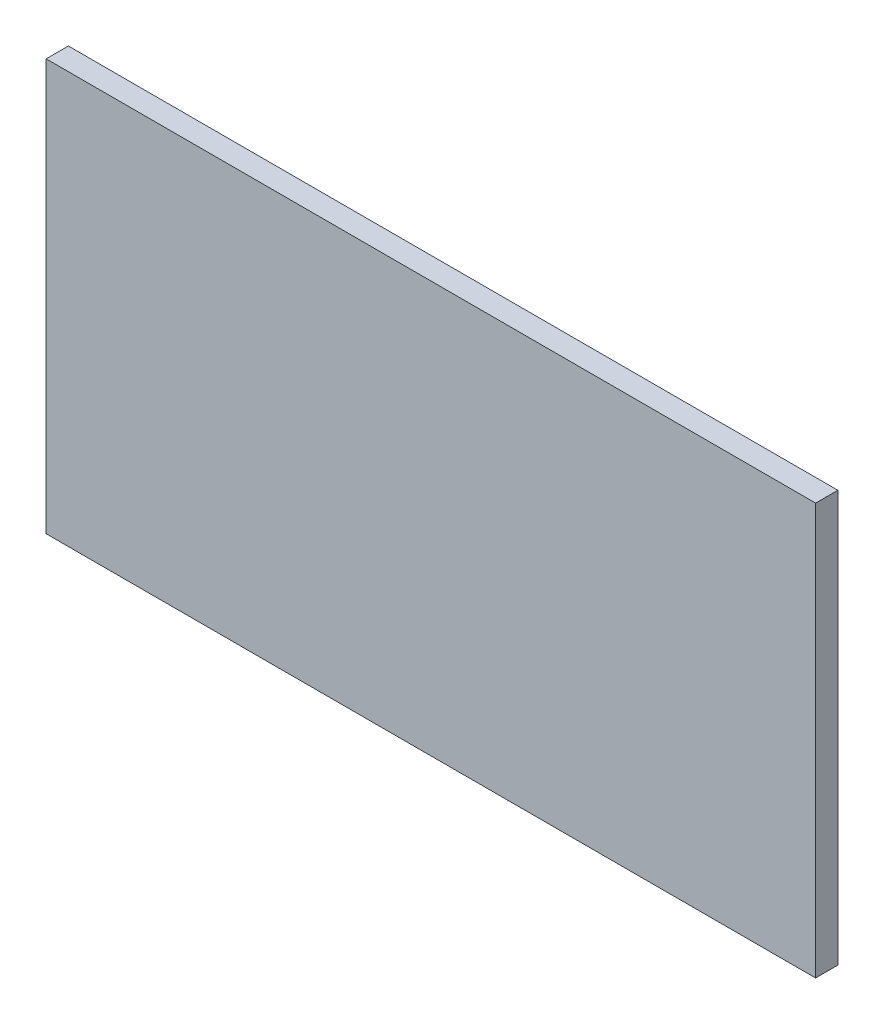
ISO-10303-21;
HEADER;
FILE_DESCRIPTION(('STEP AP214'),'2;1');
FILE_NAME('part.step','',(''),(''),'','','');
FILE_SCHEMA(('AUTOMOTIVE_DESIGN { 1 0 10303 214 1 1 1 1 }'));
ENDSEC;
DATA;
#1=APPLICATION_CONTEXT('core data for automotive mechanical design processes');
#2=APPLICATION_PROTOCOL_DEFINITION('international standard','automotive_design',2000,#1);
#3=PRODUCT_CONTEXT('',#1,'mechanical');
#4=PRODUCT('Part','Part','',(#3));
#5=PRODUCT_RELATED_PRODUCT_CATEGORY('part','',(#4));
#6=PRODUCT_DEFINITION_FORMATION('','',#4);
#7=PRODUCT_DEFINITION_CONTEXT('part definition',#1,'design');
#8=PRODUCT_DEFINITION('design','',#6,#7);
#9=PRODUCT_DEFINITION_SHAPE('','',#8);
#10=(LENGTH_UNIT() NAMED_UNIT(*) SI_UNIT(.MILLI.,.METRE.));
#11=(NAMED_UNIT(*) PLANE_ANGLE_UNIT() SI_UNIT($,.RADIAN.));
#12=(NAMED_UNIT(*) SI_UNIT($,.STERADIAN.) SOLID_ANGLE_UNIT());
#13=UNCERTAINTY_MEASURE_WITH_UNIT(LENGTH_MEASURE(1.E-05),#10,'distance_accuracy_value','');
#14=(GEOMETRIC_REPRESENTATION_CONTEXT(3) GLOBAL_UNCERTAINTY_ASSIGNED_CONTEXT((#13)) GLOBAL_UNIT_ASSIGNED_CONTEXT((#10,
#11,#12)) REPRESENTATION_CONTEXT('',''));
#15=CARTESIAN_POINT('',(0.,0.,0.));
#16=DIRECTION('',(0.,0.,1.));
#17=DIRECTION('',(1.,0.,0.));
#18=AXIS2_PLACEMENT_3D('',#15,#16,#17);
#19=CARTESIAN_POINT('',(-311.5,-166.5,18.));
#20=DIRECTION('',(1.,0.,0.));
#21=DIRECTION('',(0.,0.,-1.));
#22=AXIS2_PLACEMENT_3D('',#19,#20,#21);
#23=PLANE('',#22);
#24=DIRECTION('',(0.,-1.,0.));
#25=VECTOR('',#24,1.);
#26=CARTESIAN_POINT('',(-311.5,-166.5,0.));
#27=LINE('',#26,#25);
#28=CARTESIAN_POINT('',(-311.5,166.5,0.));
#29=VERTEX_POINT('',#28);
#30=CARTESIAN_POINT('',(-311.5,-166.5,0.));
#31=VERTEX_POINT('',#30);
#32=EDGE_CURVE('E96',#29,#31,#27,.T.);
#33=ORIENTED_EDGE('',*,*,#32,.T.);
#34=DIRECTION('',(0.,0.,-1.));
#35=VECTOR('',#34,1.);
#36=CARTESIAN_POINT('',(-311.5,-166.5,18.));
#37=LINE('',#36,#35);
#38=CARTESIAN_POINT('',(-311.5,-166.5,18.));
#39=VERTEX_POINT('',#38);
#40=EDGE_CURVE('E11',#39,#31,#37,.T.);
#41=ORIENTED_EDGE('',*,*,#40,.F.);
#42=DIRECTION('',(0.,-1.,0.));
#43=VECTOR('',#42,1.);
#44=CARTESIAN_POINT('',(-311.5,-166.5,18.));
#45=LINE('',#44,#43);
#46=CARTESIAN_POINT('',(-311.5,166.5,18.));
#47=VERTEX_POINT('',#46);
#48=EDGE_CURVE('E84',#47,#39,#45,.T.);
#49=ORIENTED_EDGE('',*,*,#48,.F.);
#50=DIRECTION('',(0.,0.,-1.));
#51=VECTOR('',#50,1.);
#52=CARTESIAN_POINT('',(-311.5,166.5,18.));
#53=LINE('',#52,#51);
#54=EDGE_CURVE('E92',#47,#29,#53,.T.);
#55=ORIENTED_EDGE('',*,*,#54,.T.);
#56=EDGE_LOOP('',(#33,#41,#49,#55));
#57=FACE_BOUND('',#56,.T.);
#58=ADVANCED_FACE('F33',(#57),#23,.F.);
#59=CARTESIAN_POINT('',(311.5,-166.5,18.));
#60=DIRECTION('',(0.,1.,0.));
#61=DIRECTION('',(-1.,0.,0.));
#62=AXIS2_PLACEMENT_3D('',#59,#60,#61);
#63=PLANE('',#62);
#64=DIRECTION('',(1.,0.,0.));
#65=VECTOR('',#64,1.);
#66=CARTESIAN_POINT('',(311.5,-166.5,0.));
#67=LINE('',#66,#65);
#68=CARTESIAN_POINT('',(311.5,-166.5,0.));
#69=VERTEX_POINT('',#68);
#70=EDGE_CURVE('E88',#31,#69,#67,.T.);
#71=ORIENTED_EDGE('',*,*,#70,.T.);
#72=DIRECTION('',(0.,0.,-1.));
#73=VECTOR('',#72,1.);
#74=CARTESIAN_POINT('',(311.5,-166.5,18.));
#75=LINE('',#74,#73);
#76=CARTESIAN_POINT('',(311.5,-166.5,18.));
#77=VERTEX_POINT('',#76);
#78=EDGE_CURVE('E41',#77,#69,#75,.T.);
#79=ORIENTED_EDGE('',*,*,#78,.F.);
#80=DIRECTION('',(1.,0.,0.));
#81=VECTOR('',#80,1.);
#82=CARTESIAN_POINT('',(311.5,-166.5,18.));
#83=LINE('',#82,#81);
#84=EDGE_CURVE('E79',#39,#77,#83,.T.);
#85=ORIENTED_EDGE('',*,*,#84,.F.);
#86=ORIENTED_EDGE('',*,*,#40,.T.);
#87=EDGE_LOOP('',(#71,#79,#85,#86));
#88=FACE_BOUND('',#87,.T.);
#89=ADVANCED_FACE('F87',(#88),#63,.F.);
#90=CARTESIAN_POINT('',(311.5,-166.5,18.));
#91=DIRECTION('',(-1.,0.,0.));
#92=DIRECTION('',(0.,0.,1.));
#93=AXIS2_PLACEMENT_3D('',#90,#91,#92);
#94=PLANE('',#93);
#95=DIRECTION('',(0.,1.,0.));
#96=VECTOR('',#95,1.);
#97=CARTESIAN_POINT('',(311.5,-166.5,0.));
#98=LINE('',#97,#96);
#99=CARTESIAN_POINT('',(311.5,166.5,0.));
#100=VERTEX_POINT('',#99);
#101=EDGE_CURVE('E66',#69,#100,#98,.T.);
#102=ORIENTED_EDGE('',*,*,#101,.T.);
#103=DIRECTION('',(0.,0.,-1.));
#104=VECTOR('',#103,1.);
#105=CARTESIAN_POINT('',(311.5,166.5,18.));
#106=LINE('',#105,#104);
#107=CARTESIAN_POINT('',(311.5,166.5,18.));
#108=VERTEX_POINT('',#107);
#109=EDGE_CURVE('E89',#108,#100,#106,.T.);
#110=ORIENTED_EDGE('',*,*,#109,.F.);
#111=DIRECTION('',(0.,1.,0.));
#112=VECTOR('',#111,1.);
#113=CARTESIAN_POINT('',(311.5,-166.5,18.));
#114=LINE('',#113,#112);
#115=EDGE_CURVE('E82',#77,#108,#114,.T.);
#116=ORIENTED_EDGE('',*,*,#115,.F.);
#117=ORIENTED_EDGE('',*,*,#78,.T.);
#118=EDGE_LOOP('',(#102,#110,#116,#117));
#119=FACE_BOUND('',#118,.T.);
#120=ADVANCED_FACE('F90',(#119),#94,.F.);
#121=CARTESIAN_POINT('',(311.5,166.5,18.));
#122=DIRECTION('',(0.,-1.,0.));
#123=DIRECTION('',(1.,0.,0.));
#124=AXIS2_PLACEMENT_3D('',#121,#122,#123);
#125=PLANE('',#124);
#126=DIRECTION('',(-1.,0.,0.));
#127=VECTOR('',#126,1.);
#128=CARTESIAN_POINT('',(311.5,166.5,0.));
#129=LINE('',#128,#127);
#130=EDGE_CURVE('E72',#100,#29,#129,.T.);
#131=ORIENTED_EDGE('',*,*,#130,.T.);
#132=ORIENTED_EDGE('',*,*,#54,.F.);
#133=DIRECTION('',(-1.,0.,0.));
#134=VECTOR('',#133,1.);
#135=CARTESIAN_POINT('',(311.5,166.5,18.));
#136=LINE('',#135,#134);
#137=EDGE_CURVE('E49',#108,#47,#136,.T.);
#138=ORIENTED_EDGE('',*,*,#137,.F.);
#139=ORIENTED_EDGE('',*,*,#109,.T.);
#140=EDGE_LOOP('',(#131,#132,#138,#139));
#141=FACE_BOUND('',#140,.T.);
#142=ADVANCED_FACE('F103',(#141),#125,.F.);
#143=CARTESIAN_POINT('',(0.,0.,18.));
#144=DIRECTION('',(0.,0.,1.));
#145=DIRECTION('',(1.,0.,0.));
#146=AXIS2_PLACEMENT_3D('',#143,#144,#145);
#147=PLANE('',#146);
#148=ORIENTED_EDGE('',*,*,#48,.T.);
#149=ORIENTED_EDGE('',*,*,#84,.T.);
#150=ORIENTED_EDGE('',*,*,#115,.T.);
#151=ORIENTED_EDGE('',*,*,#137,.T.);
#152=EDGE_LOOP('',(#148,#149,#150,#151));
#153=FACE_BOUND('',#152,.T.);
#154=ADVANCED_FACE('F80',(#153),#147,.T.);
#155=CARTESIAN_POINT('',(0.,0.,0.));
#156=DIRECTION('',(0.,0.,1.));
#157=DIRECTION('',(1.,0.,0.));
#158=AXIS2_PLACEMENT_3D('',#155,#156,#157);
#159=PLANE('',#158);
#160=ORIENTED_EDGE('',*,*,#32,.F.);
#161=ORIENTED_EDGE('',*,*,#130,.F.);
#162=ORIENTED_EDGE('',*,*,#101,.F.);
#163=ORIENTED_EDGE('',*,*,#70,.F.);
#164=EDGE_LOOP('',(#160,#161,#162,#163));
#165=FACE_BOUND('',#164,.T.);
#166=ADVANCED_FACE('F106',(#165),#159,.F.);
#167=CLOSED_SHELL('',(#58,#89,#120,#142,#154,#166));
#168=MANIFOLD_SOLID_BREP('B2',#167);
#169=ADVANCED_BREP_SHAPE_REPRESENTATION('',(#18,#168),#14);
#170=SHAPE_DEFINITION_REPRESENTATION(#9,#169);
ENDSEC;
END-ISO-10303-21;
